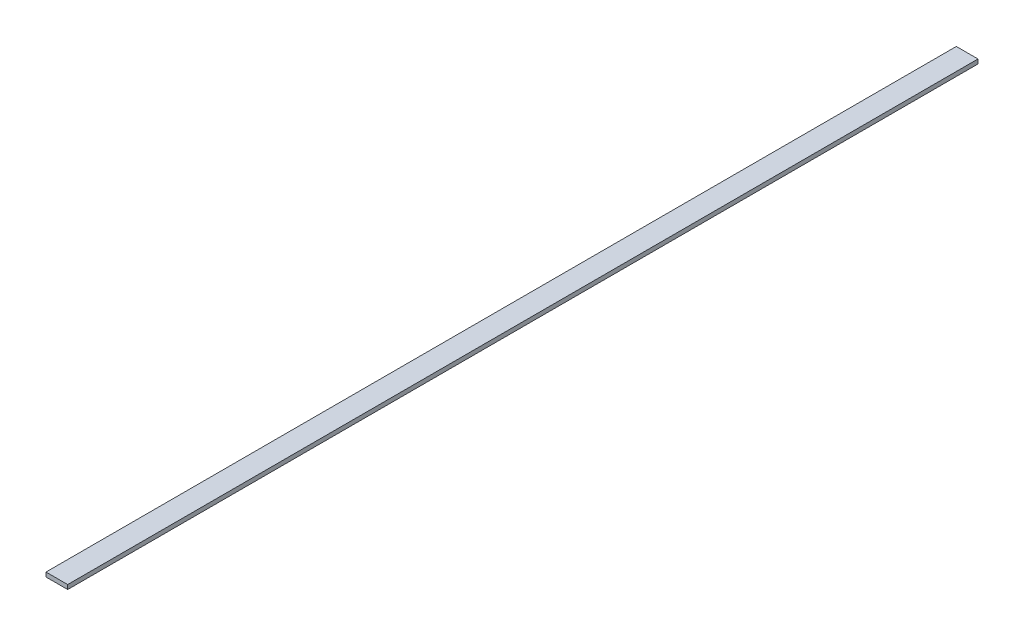
ISO-10303-21;
HEADER;
FILE_DESCRIPTION(('STEP AP214'),'2;1');
FILE_NAME('part.step','',(''),(''),'','','');
FILE_SCHEMA(('AUTOMOTIVE_DESIGN { 1 0 10303 214 1 1 1 1 }'));
ENDSEC;
DATA;
#1=APPLICATION_CONTEXT('core data for automotive mechanical design processes');
#2=APPLICATION_PROTOCOL_DEFINITION('international standard','automotive_design',2000,#1);
#3=PRODUCT_CONTEXT('',#1,'mechanical');
#4=PRODUCT('Part','Part','',(#3));
#5=PRODUCT_RELATED_PRODUCT_CATEGORY('part','',(#4));
#6=PRODUCT_DEFINITION_FORMATION('','',#4);
#7=PRODUCT_DEFINITION_CONTEXT('part definition',#1,'design');
#8=PRODUCT_DEFINITION('design','',#6,#7);
#9=PRODUCT_DEFINITION_SHAPE('','',#8);
#10=(LENGTH_UNIT() NAMED_UNIT(*) SI_UNIT(.MILLI.,.METRE.));
#11=(NAMED_UNIT(*) PLANE_ANGLE_UNIT() SI_UNIT($,.RADIAN.));
#12=(NAMED_UNIT(*) SI_UNIT($,.STERADIAN.) SOLID_ANGLE_UNIT());
#13=UNCERTAINTY_MEASURE_WITH_UNIT(LENGTH_MEASURE(1.E-05),#10,'distance_accuracy_value','');
#14=(GEOMETRIC_REPRESENTATION_CONTEXT(3) GLOBAL_UNCERTAINTY_ASSIGNED_CONTEXT((#13)) GLOBAL_UNIT_ASSIGNED_CONTEXT((#10,
#11,#12)) REPRESENTATION_CONTEXT('',''));
#15=CARTESIAN_POINT('',(0.,0.,0.));
#16=DIRECTION('',(0.,0.,1.));
#17=DIRECTION('',(1.,0.,0.));
#18=AXIS2_PLACEMENT_3D('',#15,#16,#17);
#19=CARTESIAN_POINT('',(0.,10.,0.));
#20=DIRECTION('',(1.,0.,0.));
#21=DIRECTION('',(0.,0.,-1.));
#22=AXIS2_PLACEMENT_3D('',#19,#20,#21);
#23=PLANE('',#22);
#24=DIRECTION('',(0.,0.,1.));
#25=VECTOR('',#24,1.);
#26=CARTESIAN_POINT('',(0.,0.,0.));
#27=LINE('',#26,#25);
#28=CARTESIAN_POINT('',(0.,0.,-2100.));
#29=VERTEX_POINT('',#28);
#30=CARTESIAN_POINT('',(0.,0.,0.));
#31=VERTEX_POINT('',#30);
#32=EDGE_CURVE('E94',#29,#31,#27,.T.);
#33=ORIENTED_EDGE('',*,*,#32,.T.);
#34=DIRECTION('',(0.,-1.,0.));
#35=VECTOR('',#34,1.);
#36=CARTESIAN_POINT('',(0.,10.,0.));
#37=LINE('',#36,#35);
#38=CARTESIAN_POINT('',(0.,10.,0.));
#39=VERTEX_POINT('',#38);
#40=EDGE_CURVE('E11',#39,#31,#37,.T.);
#41=ORIENTED_EDGE('',*,*,#40,.F.);
#42=DIRECTION('',(0.,0.,1.));
#43=VECTOR('',#42,1.);
#44=CARTESIAN_POINT('',(0.,10.,0.));
#45=LINE('',#44,#43);
#46=CARTESIAN_POINT('',(0.,10.,-2100.));
#47=VERTEX_POINT('',#46);
#48=EDGE_CURVE('E82',#47,#39,#45,.T.);
#49=ORIENTED_EDGE('',*,*,#48,.F.);
#50=DIRECTION('',(0.,-1.,0.));
#51=VECTOR('',#50,1.);
#52=CARTESIAN_POINT('',(0.,10.,-2100.));
#53=LINE('',#52,#51);
#54=EDGE_CURVE('E90',#47,#29,#53,.T.);
#55=ORIENTED_EDGE('',*,*,#54,.T.);
#56=EDGE_LOOP('',(#33,#41,#49,#55));
#57=FACE_BOUND('',#56,.T.);
#58=ADVANCED_FACE('F31',(#57),#23,.F.);
#59=CARTESIAN_POINT('',(0.,10.,0.));
#60=DIRECTION('',(0.,0.,-1.));
#61=DIRECTION('',(-1.,0.,0.));
#62=AXIS2_PLACEMENT_3D('',#59,#60,#61);
#63=PLANE('',#62);
#64=DIRECTION('',(1.,0.,0.));
#65=VECTOR('',#64,1.);
#66=CARTESIAN_POINT('',(0.,0.,0.));
#67=LINE('',#66,#65);
#68=CARTESIAN_POINT('',(50.,0.,0.));
#69=VERTEX_POINT('',#68);
#70=EDGE_CURVE('E86',#31,#69,#67,.T.);
#71=ORIENTED_EDGE('',*,*,#70,.T.);
#72=DIRECTION('',(0.,-1.,0.));
#73=VECTOR('',#72,1.);
#74=CARTESIAN_POINT('',(50.,10.,0.));
#75=LINE('',#74,#73);
#76=CARTESIAN_POINT('',(50.,10.,0.));
#77=VERTEX_POINT('',#76);
#78=EDGE_CURVE('E39',#77,#69,#75,.T.);
#79=ORIENTED_EDGE('',*,*,#78,.F.);
#80=DIRECTION('',(1.,0.,0.));
#81=VECTOR('',#80,1.);
#82=CARTESIAN_POINT('',(0.,10.,0.));
#83=LINE('',#82,#81);
#84=EDGE_CURVE('E77',#39,#77,#83,.T.);
#85=ORIENTED_EDGE('',*,*,#84,.F.);
#86=ORIENTED_EDGE('',*,*,#40,.T.);
#87=EDGE_LOOP('',(#71,#79,#85,#86));
#88=FACE_BOUND('',#87,.T.);
#89=ADVANCED_FACE('F85',(#88),#63,.F.);
#90=CARTESIAN_POINT('',(50.,10.,0.));
#91=DIRECTION('',(-1.,0.,0.));
#92=DIRECTION('',(0.,0.,1.));
#93=AXIS2_PLACEMENT_3D('',#90,#91,#92);
#94=PLANE('',#93);
#95=DIRECTION('',(0.,0.,-1.));
#96=VECTOR('',#95,1.);
#97=CARTESIAN_POINT('',(50.,0.,0.));
#98=LINE('',#97,#96);
#99=CARTESIAN_POINT('',(50.,0.,-2100.));
#100=VERTEX_POINT('',#99);
#101=EDGE_CURVE('E64',#69,#100,#98,.T.);
#102=ORIENTED_EDGE('',*,*,#101,.T.);
#103=DIRECTION('',(0.,-1.,0.));
#104=VECTOR('',#103,1.);
#105=CARTESIAN_POINT('',(50.,10.,-2100.));
#106=LINE('',#105,#104);
#107=CARTESIAN_POINT('',(50.,10.,-2100.));
#108=VERTEX_POINT('',#107);
#109=EDGE_CURVE('E87',#108,#100,#106,.T.);
#110=ORIENTED_EDGE('',*,*,#109,.F.);
#111=DIRECTION('',(0.,0.,-1.));
#112=VECTOR('',#111,1.);
#113=CARTESIAN_POINT('',(50.,10.,0.));
#114=LINE('',#113,#112);
#115=EDGE_CURVE('E80',#77,#108,#114,.T.);
#116=ORIENTED_EDGE('',*,*,#115,.F.);
#117=ORIENTED_EDGE('',*,*,#78,.T.);
#118=EDGE_LOOP('',(#102,#110,#116,#117));
#119=FACE_BOUND('',#118,.T.);
#120=ADVANCED_FACE('F88',(#119),#94,.F.);
#121=CARTESIAN_POINT('',(0.,10.,-2100.));
#122=DIRECTION('',(0.,0.,1.));
#123=DIRECTION('',(1.,0.,0.));
#124=AXIS2_PLACEMENT_3D('',#121,#122,#123);
#125=PLANE('',#124);
#126=DIRECTION('',(-1.,0.,0.));
#127=VECTOR('',#126,1.);
#128=CARTESIAN_POINT('',(0.,0.,-2100.));
#129=LINE('',#128,#127);
#130=EDGE_CURVE('E70',#100,#29,#129,.T.);
#131=ORIENTED_EDGE('',*,*,#130,.T.);
#132=ORIENTED_EDGE('',*,*,#54,.F.);
#133=DIRECTION('',(-1.,0.,0.));
#134=VECTOR('',#133,1.);
#135=CARTESIAN_POINT('',(0.,10.,-2100.));
#136=LINE('',#135,#134);
#137=EDGE_CURVE('E47',#108,#47,#136,.T.);
#138=ORIENTED_EDGE('',*,*,#137,.F.);
#139=ORIENTED_EDGE('',*,*,#109,.T.);
#140=EDGE_LOOP('',(#131,#132,#138,#139));
#141=FACE_BOUND('',#140,.T.);
#142=ADVANCED_FACE('F101',(#141),#125,.F.);
#143=CARTESIAN_POINT('',(0.,10.,-2100.));
#144=DIRECTION('',(0.,-1.,0.));
#145=DIRECTION('',(0.,0.,-1.));
#146=AXIS2_PLACEMENT_3D('',#143,#144,#145);
#147=PLANE('',#146);
#148=ORIENTED_EDGE('',*,*,#48,.T.);
#149=ORIENTED_EDGE('',*,*,#84,.T.);
#150=ORIENTED_EDGE('',*,*,#115,.T.);
#151=ORIENTED_EDGE('',*,*,#137,.T.);
#152=EDGE_LOOP('',(#148,#149,#150,#151));
#153=FACE_BOUND('',#152,.T.);
#154=ADVANCED_FACE('F78',(#153),#147,.F.);
#155=CARTESIAN_POINT('',(0.,0.,-2100.));
#156=DIRECTION('',(0.,-1.,0.));
#157=DIRECTION('',(0.,0.,-1.));
#158=AXIS2_PLACEMENT_3D('',#155,#156,#157);
#159=PLANE('',#158);
#160=ORIENTED_EDGE('',*,*,#32,.F.);
#161=ORIENTED_EDGE('',*,*,#130,.F.);
#162=ORIENTED_EDGE('',*,*,#101,.F.);
#163=ORIENTED_EDGE('',*,*,#70,.F.);
#164=EDGE_LOOP('',(#160,#161,#162,#163));
#165=FACE_BOUND('',#164,.T.);
#166=ADVANCED_FACE('F104',(#165),#159,.T.);
#167=CLOSED_SHELL('',(#58,#89,#120,#142,#154,#166));
#168=MANIFOLD_SOLID_BREP('B2',#167);
#169=ADVANCED_BREP_SHAPE_REPRESENTATION('',(#18,#168),#14);
#170=SHAPE_DEFINITION_REPRESENTATION(#9,#169);
ENDSEC;
END-ISO-10303-21;
